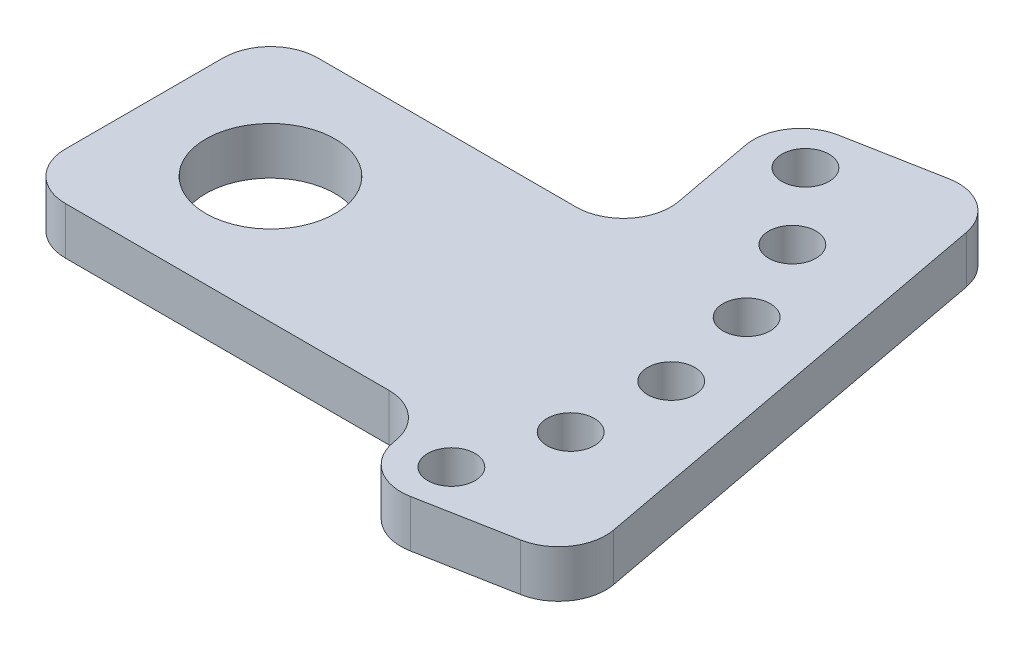
ISO-10303-21;
HEADER;
FILE_DESCRIPTION(('STEP AP214'),'2;1');
FILE_NAME('part.step','',(''),(''),'','','');
FILE_SCHEMA(('AUTOMOTIVE_DESIGN { 1 0 10303 214 1 1 1 1 }'));
ENDSEC;
DATA;
#1=APPLICATION_CONTEXT('core data for automotive mechanical design processes');
#2=APPLICATION_PROTOCOL_DEFINITION('international standard','automotive_design',2000,#1);
#3=PRODUCT_CONTEXT('',#1,'mechanical');
#4=PRODUCT('Part','Part','',(#3));
#5=PRODUCT_RELATED_PRODUCT_CATEGORY('part','',(#4));
#6=PRODUCT_DEFINITION_FORMATION('','',#4);
#7=PRODUCT_DEFINITION_CONTEXT('part definition',#1,'design');
#8=PRODUCT_DEFINITION('design','',#6,#7);
#9=PRODUCT_DEFINITION_SHAPE('','',#8);
#10=(LENGTH_UNIT() NAMED_UNIT(*) SI_UNIT(.MILLI.,.METRE.));
#11=(NAMED_UNIT(*) PLANE_ANGLE_UNIT() SI_UNIT($,.RADIAN.));
#12=(NAMED_UNIT(*) SI_UNIT($,.STERADIAN.) SOLID_ANGLE_UNIT());
#13=UNCERTAINTY_MEASURE_WITH_UNIT(LENGTH_MEASURE(1.E-05),#10,'distance_accuracy_value','');
#14=(GEOMETRIC_REPRESENTATION_CONTEXT(3) GLOBAL_UNCERTAINTY_ASSIGNED_CONTEXT((#13)) GLOBAL_UNIT_ASSIGNED_CONTEXT((#10,
#11,#12)) REPRESENTATION_CONTEXT('',''));
#15=CARTESIAN_POINT('',(0.,0.,0.));
#16=DIRECTION('',(0.,0.,1.));
#17=DIRECTION('',(1.,0.,0.));
#18=AXIS2_PLACEMENT_3D('',#15,#16,#17);
#19=CARTESIAN_POINT('',(135.881010461342,15.,-25.4776894615016));
#20=DIRECTION('',(0.982872186934322,0.,-0.184288535050185));
#21=DIRECTION('',(0.184288535050185,0.,0.982872186934322));
#22=AXIS2_PLACEMENT_3D('',#19,#20,#21);
#23=PLANE('',#22);
#24=DIRECTION('',(0.184288535050185,0.,0.982872186934322));
#25=VECTOR('',#24,1.);
#26=CARTESIAN_POINT('',(135.881010461342,0.,-25.4776894615016));
#27=LINE('',#26,#25);
#28=CARTESIAN_POINT('',(125.751975799736,0.,-79.4992076567357));
#29=VERTEX_POINT('',#28);
#30=CARTESIAN_POINT('',(151.552370706762,0.,58.1028985140693));
#31=VERTEX_POINT('',#30);
#32=EDGE_CURVE('E183',#29,#31,#27,.T.);
#33=ORIENTED_EDGE('',*,*,#32,.F.);
#34=DIRECTION('',(0.,1.,0.));
#35=VECTOR('',#34,1.);
#36=CARTESIAN_POINT('',(125.751975799736,15.,-79.4992076567357));
#37=LINE('',#36,#35);
#38=CARTESIAN_POINT('',(125.751975799736,15.,-79.4992076567357));
#39=VERTEX_POINT('',#38);
#40=EDGE_CURVE('E229',#39,#29,#37,.F.);
#41=ORIENTED_EDGE('',*,*,#40,.F.);
#42=DIRECTION('',(0.184288535050185,0.,0.982872186934322));
#43=VECTOR('',#42,1.);
#44=CARTESIAN_POINT('',(135.881010461342,15.,-25.4776894615016));
#45=LINE('',#44,#43);
#46=CARTESIAN_POINT('',(151.552370706762,15.,58.1028985140693));
#47=VERTEX_POINT('',#46);
#48=EDGE_CURVE('E306',#39,#47,#45,.T.);
#49=ORIENTED_EDGE('',*,*,#48,.T.);
#50=DIRECTION('',(0.,-1.,0.));
#51=VECTOR('',#50,1.);
#52=CARTESIAN_POINT('',(151.552370706762,15.,58.1028985140693));
#53=LINE('',#52,#51);
#54=EDGE_CURVE('E231',#31,#47,#53,.F.);
#55=ORIENTED_EDGE('',*,*,#54,.F.);
#56=EDGE_LOOP('',(#33,#41,#49,#55));
#57=FACE_BOUND('',#56,.T.);
#58=ADVANCED_FACE('F36',(#57),#23,.T.);
#59=CARTESIAN_POINT('',(18.4356882711724,15.,98.3236707795859));
#60=DIRECTION('',(-0.184288535050185,0.,-0.982872186934322));
#61=DIRECTION('',(0.982872186934322,0.,-0.184288535050185));
#62=AXIS2_PLACEMENT_3D('',#59,#60,#61);
#63=PLANE('',#62);
#64=DIRECTION('',(0.982872186934322,0.,-0.184288535050185));
#65=VECTOR('',#64,1.);
#66=CARTESIAN_POINT('',(18.4356882711724,0.,98.3236707795859));
#67=LINE('',#66,#65);
#68=CARTESIAN_POINT('',(110.08745032047,0.,81.1389653953425));
#69=VERTEX_POINT('',#68);
#70=CARTESIAN_POINT('',(139.5736159285,0.,75.6103093438369));
#71=VERTEX_POINT('',#70);
#72=EDGE_CURVE('E178',#69,#71,#67,.T.);
#73=ORIENTED_EDGE('',*,*,#72,.T.);
#74=DIRECTION('',(0.,1.,0.));
#75=VECTOR('',#74,1.);
#76=CARTESIAN_POINT('',(139.5736159285,15.,75.610309343837));
#77=LINE('',#76,#75);
#78=CARTESIAN_POINT('',(139.5736159285,15.,75.6103093438369));
#79=VERTEX_POINT('',#78);
#80=EDGE_CURVE('E202',#79,#71,#77,.F.);
#81=ORIENTED_EDGE('',*,*,#80,.F.);
#82=DIRECTION('',(0.982872186934322,0.,-0.184288535050185));
#83=VECTOR('',#82,1.);
#84=CARTESIAN_POINT('',(18.4356882711724,15.,98.3236707795859));
#85=LINE('',#84,#83);
#86=CARTESIAN_POINT('',(110.08745032047,15.,81.1389653953425));
#87=VERTEX_POINT('',#86);
#88=EDGE_CURVE('E304',#87,#79,#85,.T.);
#89=ORIENTED_EDGE('',*,*,#88,.F.);
#90=DIRECTION('',(0.,-1.,0.));
#91=VECTOR('',#90,1.);
#92=CARTESIAN_POINT('',(110.08745032047,15.,81.1389653953425));
#93=LINE('',#92,#91);
#94=EDGE_CURVE('E205',#69,#87,#93,.F.);
#95=ORIENTED_EDGE('',*,*,#94,.F.);
#96=EDGE_LOOP('',(#73,#81,#89,#95));
#97=FACE_BOUND('',#96,.T.);
#98=ADVANCED_FACE('F361',(#97),#63,.F.);
#99=CARTESIAN_POINT('',(76.908679245283,15.,-14.4203773584906));
#100=DIRECTION('',(0.982872186934322,0.,-0.184288535050185));
#101=DIRECTION('',(0.184288535050185,0.,0.982872186934322));
#102=AXIS2_PLACEMENT_3D('',#99,#100,#101);
#103=PLANE('',#102);
#104=DIRECTION('',(0.184288535050185,0.,0.982872186934322));
#105=VECTOR('',#104,1.);
#106=CARTESIAN_POINT('',(76.908679245283,0.,-14.4203773584906));
#107=LINE('',#106,#105);
#108=CARTESIAN_POINT('',(92.2941884951713,0.,67.6356719742472));
#109=VERTEX_POINT('',#108);
#110=CARTESIAN_POINT('',(92.5800394907026,0.,69.1602106170805));
#111=VERTEX_POINT('',#110);
#112=EDGE_CURVE('E166',#109,#111,#107,.T.);
#113=ORIENTED_EDGE('',*,*,#112,.T.);
#114=DIRECTION('',(0.,-1.,0.));
#115=VECTOR('',#114,1.);
#116=CARTESIAN_POINT('',(92.5800394907026,15.,69.1602106170805));
#117=LINE('',#116,#115);
#118=CARTESIAN_POINT('',(92.5800394907026,15.,69.1602106170805));
#119=VERTEX_POINT('',#118);
#120=EDGE_CURVE('E170',#119,#111,#117,.T.);
#121=ORIENTED_EDGE('',*,*,#120,.F.);
#122=DIRECTION('',(0.184288535050185,0.,0.982872186934322));
#123=VECTOR('',#122,1.);
#124=CARTESIAN_POINT('',(76.908679245283,15.,-14.4203773584906));
#125=LINE('',#124,#123);
#126=CARTESIAN_POINT('',(92.2941884951713,15.,67.6356719742472));
#127=VERTEX_POINT('',#126);
#128=EDGE_CURVE('E168',#127,#119,#125,.T.);
#129=ORIENTED_EDGE('',*,*,#128,.F.);
#130=DIRECTION('',(0.,1.,0.));
#131=VECTOR('',#130,1.);
#132=CARTESIAN_POINT('',(92.2941884951713,15.,67.6356719742472));
#133=LINE('',#132,#131);
#134=EDGE_CURVE('E153',#109,#127,#133,.T.);
#135=ORIENTED_EDGE('',*,*,#134,.F.);
#136=EDGE_LOOP('',(#113,#121,#129,#135));
#137=FACE_BOUND('',#136,.T.);
#138=ADVANCED_FACE('F164',(#137),#103,.F.);
#139=CARTESIAN_POINT('',(0.,15.,55.4));
#140=DIRECTION('',(0.,0.,1.));
#141=DIRECTION('',(-1.,0.,0.));
#142=AXIS2_PLACEMENT_3D('',#139,#140,#141);
#143=PLANE('',#142);
#144=DIRECTION('',(-1.,0.,0.));
#145=VECTOR('',#144,1.);
#146=CARTESIAN_POINT('',(0.,15.,55.4));
#147=LINE('',#146,#145);
#148=CARTESIAN_POINT('',(77.5511056911565,15.,55.4));
#149=VERTEX_POINT('',#148);
#150=CARTESIAN_POINT('',(-25.,15.,55.4));
#151=VERTEX_POINT('',#150);
#152=EDGE_CURVE('E298',#149,#151,#147,.T.);
#153=ORIENTED_EDGE('',*,*,#152,.T.);
#154=DIRECTION('',(0.,-1.,0.));
#155=VECTOR('',#154,1.);
#156=CARTESIAN_POINT('',(-25.,15.,55.4));
#157=LINE('',#156,#155);
#158=CARTESIAN_POINT('',(-25.,0.,55.4));
#159=VERTEX_POINT('',#158);
#160=EDGE_CURVE('E169',#159,#151,#157,.F.);
#161=ORIENTED_EDGE('',*,*,#160,.F.);
#162=DIRECTION('',(-1.,0.,0.));
#163=VECTOR('',#162,1.);
#164=CARTESIAN_POINT('',(0.,0.,55.4));
#165=LINE('',#164,#163);
#166=CARTESIAN_POINT('',(77.5511056911565,0.,55.4));
#167=VERTEX_POINT('',#166);
#168=EDGE_CURVE('E177',#167,#159,#165,.T.);
#169=ORIENTED_EDGE('',*,*,#168,.F.);
#170=DIRECTION('',(0.,-1.,0.));
#171=VECTOR('',#170,1.);
#172=CARTESIAN_POINT('',(77.5511056911565,0.,55.4));
#173=LINE('',#172,#171);
#174=EDGE_CURVE('E156',#149,#167,#173,.T.);
#175=ORIENTED_EDGE('',*,*,#174,.F.);
#176=EDGE_LOOP('',(#153,#161,#169,#175));
#177=FACE_BOUND('',#176,.T.);
#178=ADVANCED_FACE('F412',(#177),#143,.T.);
#179=CARTESIAN_POINT('',(-40.,15.,0.));
#180=DIRECTION('',(1.,0.,0.));
#181=DIRECTION('',(0.,0.,1.));
#182=AXIS2_PLACEMENT_3D('',#179,#180,#181);
#183=PLANE('',#182);
#184=DIRECTION('',(0.,0.,1.));
#185=VECTOR('',#184,1.);
#186=CARTESIAN_POINT('',(-40.,15.,0.));
#187=LINE('',#186,#185);
#188=CARTESIAN_POINT('',(-40.,15.,-9.60000000000003));
#189=VERTEX_POINT('',#188);
#190=CARTESIAN_POINT('',(-40.,15.,40.4));
#191=VERTEX_POINT('',#190);
#192=EDGE_CURVE('E299',#189,#191,#187,.T.);
#193=ORIENTED_EDGE('',*,*,#192,.F.);
#194=DIRECTION('',(0.,-1.,0.));
#195=VECTOR('',#194,1.);
#196=CARTESIAN_POINT('',(-40.,15.,-9.60000000000003));
#197=LINE('',#196,#195);
#198=CARTESIAN_POINT('',(-40.,0.,-9.60000000000003));
#199=VERTEX_POINT('',#198);
#200=EDGE_CURVE('E250',#199,#189,#197,.F.);
#201=ORIENTED_EDGE('',*,*,#200,.F.);
#202=DIRECTION('',(0.,0.,1.));
#203=VECTOR('',#202,1.);
#204=CARTESIAN_POINT('',(-40.,0.,0.));
#205=LINE('',#204,#203);
#206=CARTESIAN_POINT('',(-40.,0.,40.4));
#207=VERTEX_POINT('',#206);
#208=EDGE_CURVE('E180',#199,#207,#205,.T.);
#209=ORIENTED_EDGE('',*,*,#208,.T.);
#210=DIRECTION('',(0.,1.,0.));
#211=VECTOR('',#210,1.);
#212=CARTESIAN_POINT('',(-40.,15.,40.4));
#213=LINE('',#212,#211);
#214=EDGE_CURVE('E253',#191,#207,#213,.F.);
#215=ORIENTED_EDGE('',*,*,#214,.F.);
#216=EDGE_LOOP('',(#193,#201,#209,#215));
#217=FACE_BOUND('',#216,.T.);
#218=ADVANCED_FACE('F290',(#217),#183,.F.);
#219=CARTESIAN_POINT('',(0.,15.,-24.6));
#220=DIRECTION('',(0.,0.,1.));
#221=DIRECTION('',(-1.,0.,0.));
#222=AXIS2_PLACEMENT_3D('',#219,#220,#221);
#223=PLANE('',#222);
#224=DIRECTION('',(-1.,0.,0.));
#225=VECTOR('',#224,1.);
#226=CARTESIAN_POINT('',(0.,0.,-24.6));
#227=LINE('',#226,#225);
#228=CARTESIAN_POINT('',(56.9261056911565,0.,-24.6));
#229=VERTEX_POINT('',#228);
#230=CARTESIAN_POINT('',(-25.,0.,-24.6));
#231=VERTEX_POINT('',#230);
#232=EDGE_CURVE('E196',#229,#231,#227,.T.);
#233=ORIENTED_EDGE('',*,*,#232,.T.);
#234=DIRECTION('',(0.,-1.,0.));
#235=VECTOR('',#234,1.);
#236=CARTESIAN_POINT('',(-25.,15.,-24.6));
#237=LINE('',#236,#235);
#238=CARTESIAN_POINT('',(-25.,15.,-24.6));
#239=VERTEX_POINT('',#238);
#240=EDGE_CURVE('E244',#239,#231,#237,.T.);
#241=ORIENTED_EDGE('',*,*,#240,.F.);
#242=DIRECTION('',(-1.,0.,0.));
#243=VECTOR('',#242,1.);
#244=CARTESIAN_POINT('',(0.,15.,-24.6));
#245=LINE('',#244,#243);
#246=CARTESIAN_POINT('',(56.9261056911565,15.,-24.6));
#247=VERTEX_POINT('',#246);
#248=EDGE_CURVE('E300',#247,#239,#245,.T.);
#249=ORIENTED_EDGE('',*,*,#248,.F.);
#250=DIRECTION('',(0.,-1.,0.));
#251=VECTOR('',#250,1.);
#252=CARTESIAN_POINT('',(56.9261056911565,15.,-24.6));
#253=LINE('',#252,#251);
#254=EDGE_CURVE('E247',#229,#247,#253,.F.);
#255=ORIENTED_EDGE('',*,*,#254,.F.);
#256=EDGE_LOOP('',(#233,#241,#249,#255));
#257=FACE_BOUND('',#256,.T.);
#258=ADVANCED_FACE('F404',(#257),#223,.F.);
#259=DIRECTION('',(0.184288535050185,0.,0.982872186934322));
#260=VECTOR('',#259,1.);
#261=CARTESIAN_POINT('',(76.908679245283,0.,-14.4203773584906));
#262=LINE('',#261,#260);
#263=CARTESIAN_POINT('',(66.7796445836767,0.,-68.4418955537245));
#264=VERTEX_POINT('',#263);
#265=CARTESIAN_POINT('',(71.6691884951714,0.,-42.3643280257528));
#266=VERTEX_POINT('',#265);
#267=EDGE_CURVE('E191',#264,#266,#262,.T.);
#268=ORIENTED_EDGE('',*,*,#267,.T.);
#269=DIRECTION('',(0.,-1.,0.));
#270=VECTOR('',#269,1.);
#271=CARTESIAN_POINT('',(71.6691884951714,0.,-42.3643280257528));
#272=LINE('',#271,#270);
#273=CARTESIAN_POINT('',(71.6691884951714,15.,-42.3643280257528));
#274=VERTEX_POINT('',#273);
#275=EDGE_CURVE('E238',#274,#266,#272,.T.);
#276=ORIENTED_EDGE('',*,*,#275,.F.);
#277=CARTESIAN_POINT('',(66.7796445836767,15.,-68.4418955537245));
#278=VERTEX_POINT('',#277);
#279=EDGE_CURVE('E195',#278,#274,#125,.T.);
#280=ORIENTED_EDGE('',*,*,#279,.F.);
#281=DIRECTION('',(0.,1.,0.));
#282=VECTOR('',#281,1.);
#283=CARTESIAN_POINT('',(66.7796445836767,15.,-68.4418955537245));
#284=LINE('',#283,#282);
#285=EDGE_CURVE('E241',#264,#278,#284,.T.);
#286=ORIENTED_EDGE('',*,*,#285,.F.);
#287=EDGE_LOOP('',(#268,#276,#280,#286));
#288=FACE_BOUND('',#287,.T.);
#289=ADVANCED_FACE('F274',(#288),#103,.F.);
#290=CARTESIAN_POINT('',(-12.8933626873591,15.,-68.7646009992488));
#291=DIRECTION('',(-0.184288535050185,0.,-0.982872186934322));
#292=DIRECTION('',(0.982872186934322,0.,-0.184288535050185));
#293=AXIS2_PLACEMENT_3D('',#290,#291,#292);
#294=PLANE('',#293);
#295=DIRECTION('',(0.982872186934322,0.,-0.184288535050185));
#296=VECTOR('',#295,1.);
#297=CARTESIAN_POINT('',(-12.8933626873591,0.,-68.7646009992488));
#298=LINE('',#297,#296);
#299=CARTESIAN_POINT('',(78.7583993619387,0.,-85.9493063834922));
#300=VERTEX_POINT('',#299);
#301=CARTESIAN_POINT('',(108.244564969968,0.,-91.4779624349977));
#302=VERTEX_POINT('',#301);
#303=EDGE_CURVE('E189',#300,#302,#298,.T.);
#304=ORIENTED_EDGE('',*,*,#303,.F.);
#305=DIRECTION('',(0.,-1.,0.));
#306=VECTOR('',#305,1.);
#307=CARTESIAN_POINT('',(78.7583993619387,15.,-85.9493063834922));
#308=LINE('',#307,#306);
#309=CARTESIAN_POINT('',(78.7583993619387,15.,-85.9493063834922));
#310=VERTEX_POINT('',#309);
#311=EDGE_CURVE('E234',#310,#300,#308,.T.);
#312=ORIENTED_EDGE('',*,*,#311,.F.);
#313=DIRECTION('',(0.982872186934322,0.,-0.184288535050185));
#314=VECTOR('',#313,1.);
#315=CARTESIAN_POINT('',(-12.8933626873591,15.,-68.7646009992488));
#316=LINE('',#315,#314);
#317=CARTESIAN_POINT('',(108.244564969968,15.,-91.4779624349977));
#318=VERTEX_POINT('',#317);
#319=EDGE_CURVE('E272',#310,#318,#316,.T.);
#320=ORIENTED_EDGE('',*,*,#319,.T.);
#321=DIRECTION('',(0.,1.,0.));
#322=VECTOR('',#321,1.);
#323=CARTESIAN_POINT('',(108.244564969968,15.,-91.4779624349977));
#324=LINE('',#323,#322);
#325=EDGE_CURVE('E236',#302,#318,#324,.T.);
#326=ORIENTED_EDGE('',*,*,#325,.F.);
#327=EDGE_LOOP('',(#304,#312,#320,#326));
#328=FACE_BOUND('',#327,.T.);
#329=ADVANCED_FACE('F372',(#328),#294,.T.);
#330=CARTESIAN_POINT('',(0.,15.,15.4));
#331=DIRECTION('',(0.,1.,0.));
#332=DIRECTION('',(0.,0.,1.));
#333=AXIS2_PLACEMENT_3D('',#330,#331,#332);
#334=CYLINDRICAL_SURFACE('',#333,20.5);
#335=CARTESIAN_POINT('',(0.,15.,15.4));
#336=DIRECTION('',(0.,-1.,0.));
#337=DIRECTION('',(0.,0.,1.));
#338=AXIS2_PLACEMENT_3D('',#335,#336,#337);
#339=CIRCLE('',#338,20.5);
#340=CARTESIAN_POINT('',(0.,15.,35.9));
#341=VERTEX_POINT('',#340);
#342=EDGE_CURVE('E197',#341,#341,#339,.T.);
#343=ORIENTED_EDGE('',*,*,#342,.F.);
#344=EDGE_LOOP('',(#343));
#345=FACE_BOUND('',#344,.T.);
#346=CARTESIAN_POINT('',(0.,0.,15.4));
#347=DIRECTION('',(0.,-1.,0.));
#348=DIRECTION('',(0.,0.,1.));
#349=AXIS2_PLACEMENT_3D('',#346,#347,#348);
#350=CIRCLE('',#349,20.5);
#351=CARTESIAN_POINT('',(0.,0.,35.9));
#352=VERTEX_POINT('',#351);
#353=EDGE_CURVE('E192',#352,#352,#350,.T.);
#354=ORIENTED_EDGE('',*,*,#353,.T.);
#355=EDGE_LOOP('',(#354));
#356=FACE_BOUND('',#355,.T.);
#357=ADVANCED_FACE('F375',(#345,#356),#334,.F.);
#358=CARTESIAN_POINT('',(0.,15.,0.));
#359=DIRECTION('',(0.,1.,0.));
#360=DIRECTION('',(0.,0.,1.));
#361=AXIS2_PLACEMENT_3D('',#358,#359,#360);
#362=PLANE('',#361);
#363=CARTESIAN_POINT('',(108.541109972621,15.,66.5744804166233));
#364=DIRECTION('',(0.,-1.,0.));
#365=DIRECTION('',(0.,0.,1.));
#366=AXIS2_PLACEMENT_3D('',#363,#364,#365);
#367=CIRCLE('',#366,7.49999999999999);
#368=CARTESIAN_POINT('',(108.541109972621,15.,74.0744804166232));
#369=VERTEX_POINT('',#368);
#370=EDGE_CURVE('E340',#369,#369,#367,.T.);
#371=ORIENTED_EDGE('',*,*,#370,.T.);
#372=EDGE_LOOP('',(#371));
#373=FACE_BOUND('',#372,.T.);
#374=CARTESIAN_POINT('',(117.842476722414,15.,38.0528294022474));
#375=DIRECTION('',(0.,-1.,0.));
#376=DIRECTION('',(0.,0.,1.));
#377=AXIS2_PLACEMENT_3D('',#374,#375,#376);
#378=CIRCLE('',#377,7.49999999999999);
#379=CARTESIAN_POINT('',(117.842476722414,15.,45.5528294022474));
#380=VERTEX_POINT('',#379);
#381=EDGE_CURVE('E334',#380,#380,#378,.T.);
#382=ORIENTED_EDGE('',*,*,#381,.T.);
#383=EDGE_LOOP('',(#382));
#384=FACE_BOUND('',#383,.T.);
#385=CARTESIAN_POINT('',(119.778688677056,15.,8.11537655023096));
#386=DIRECTION('',(0.,-1.,0.));
#387=DIRECTION('',(0.,0.,1.));
#388=AXIS2_PLACEMENT_3D('',#385,#386,#387);
#389=CIRCLE('',#388,7.49999999999999);
#390=CARTESIAN_POINT('',(119.778688677056,15.,15.615376550231));
#391=VERTEX_POINT('',#390);
#392=EDGE_CURVE('E328',#391,#391,#389,.T.);
#393=ORIENTED_EDGE('',*,*,#392,.T.);
#394=EDGE_LOOP('',(#393));
#395=FACE_BOUND('',#394,.T.);
#396=CARTESIAN_POINT('',(114.228732589382,15.,-21.366787336175));
#397=DIRECTION('',(0.,-1.,0.));
#398=DIRECTION('',(0.,0.,1.));
#399=AXIS2_PLACEMENT_3D('',#396,#397,#398);
#400=CIRCLE('',#399,7.49999999999999);
#401=CARTESIAN_POINT('',(114.228732589382,15.,-13.866787336175));
#402=VERTEX_POINT('',#401);
#403=EDGE_CURVE('E322',#402,#402,#400,.T.);
#404=ORIENTED_EDGE('',*,*,#403,.T.);
#405=EDGE_LOOP('',(#404));
#406=FACE_BOUND('',#405,.T.);
#407=CARTESIAN_POINT('',(101.539480714871,15.,-48.5510270140699));
#408=DIRECTION('',(0.,-1.,0.));
#409=DIRECTION('',(0.,0.,1.));
#410=AXIS2_PLACEMENT_3D('',#407,#408,#409);
#411=CIRCLE('',#410,7.49999999999999);
#412=CARTESIAN_POINT('',(101.539480714871,15.,-41.0510270140699));
#413=VERTEX_POINT('',#412);
#414=EDGE_CURVE('E316',#413,#413,#411,.T.);
#415=ORIENTED_EDGE('',*,*,#414,.T.);
#416=EDGE_LOOP('',(#415));
#417=FACE_BOUND('',#416,.T.);
#418=CARTESIAN_POINT('',(82.5040112956812,15.,-71.7383275035854));
#419=DIRECTION('',(0.,-1.,0.));
#420=DIRECTION('',(0.,0.,1.));
#421=AXIS2_PLACEMENT_3D('',#418,#419,#420);
#422=CIRCLE('',#421,7.49999999999999);
#423=CARTESIAN_POINT('',(82.5040112956812,15.,-64.2383275035855));
#424=VERTEX_POINT('',#423);
#425=EDGE_CURVE('E278',#424,#424,#422,.T.);
#426=ORIENTED_EDGE('',*,*,#425,.T.);
#427=EDGE_LOOP('',(#426));
#428=FACE_BOUND('',#427,.T.);
#429=ORIENTED_EDGE('',*,*,#88,.T.);
#430=CARTESIAN_POINT('',(136.809287902747,15.,60.8672265398221));
#431=DIRECTION('',(0.,-1.,0.));
#432=DIRECTION('',(0.,0.,1.));
#433=AXIS2_PLACEMENT_3D('',#430,#431,#432);
#434=CIRCLE('',#433,15.);
#435=EDGE_CURVE('E216',#47,#79,#434,.T.);
#436=ORIENTED_EDGE('',*,*,#435,.F.);
#437=ORIENTED_EDGE('',*,*,#48,.F.);
#438=CARTESIAN_POINT('',(111.008892995721,15.,-76.7348796309829));
#439=DIRECTION('',(0.,-1.,0.));
#440=DIRECTION('',(0.,0.,1.));
#441=AXIS2_PLACEMENT_3D('',#438,#439,#440);
#442=CIRCLE('',#441,15.);
#443=EDGE_CURVE('E214',#318,#39,#442,.T.);
#444=ORIENTED_EDGE('',*,*,#443,.F.);
#445=ORIENTED_EDGE('',*,*,#319,.F.);
#446=CARTESIAN_POINT('',(81.5227273876915,15.,-71.2062235794773));
#447=DIRECTION('',(0.,-1.,0.));
#448=DIRECTION('',(0.,0.,1.));
#449=AXIS2_PLACEMENT_3D('',#446,#447,#448);
#450=CIRCLE('',#449,15.);
#451=EDGE_CURVE('E212',#278,#310,#450,.T.);
#452=ORIENTED_EDGE('',*,*,#451,.F.);
#453=ORIENTED_EDGE('',*,*,#279,.T.);
#454=CARTESIAN_POINT('',(56.9261056911565,15.,-39.6));
#455=DIRECTION('',(0.,-1.,0.));
#456=DIRECTION('',(0.,0.,1.));
#457=AXIS2_PLACEMENT_3D('',#454,#455,#456);
#458=CIRCLE('',#457,15.);
#459=EDGE_CURVE('E44',#247,#274,#458,.F.);
#460=ORIENTED_EDGE('',*,*,#459,.F.);
#461=ORIENTED_EDGE('',*,*,#248,.T.);
#462=CARTESIAN_POINT('',(-25.,15.,-9.60000000000002));
#463=DIRECTION('',(0.,-1.,0.));
#464=DIRECTION('',(0.,0.,1.));
#465=AXIS2_PLACEMENT_3D('',#462,#463,#464);
#466=CIRCLE('',#465,15.);
#467=EDGE_CURVE('E208',#189,#239,#466,.T.);
#468=ORIENTED_EDGE('',*,*,#467,.F.);
#469=ORIENTED_EDGE('',*,*,#192,.T.);
#470=CARTESIAN_POINT('',(-25.,15.,40.4));
#471=DIRECTION('',(0.,-1.,0.));
#472=DIRECTION('',(0.,0.,1.));
#473=AXIS2_PLACEMENT_3D('',#470,#471,#472);
#474=CIRCLE('',#473,15.);
#475=EDGE_CURVE('E210',#151,#191,#474,.T.);
#476=ORIENTED_EDGE('',*,*,#475,.F.);
#477=ORIENTED_EDGE('',*,*,#152,.F.);
#478=CARTESIAN_POINT('',(77.5511056911565,15.,70.4));
#479=DIRECTION('',(0.,-1.,0.));
#480=DIRECTION('',(0.,0.,1.));
#481=AXIS2_PLACEMENT_3D('',#478,#479,#480);
#482=CIRCLE('',#481,15.);
#483=EDGE_CURVE('E160',#127,#149,#482,.F.);
#484=ORIENTED_EDGE('',*,*,#483,.F.);
#485=ORIENTED_EDGE('',*,*,#128,.T.);
#486=CARTESIAN_POINT('',(107.323122294717,15.,66.3958825913277));
#487=DIRECTION('',(0.,-1.,0.));
#488=DIRECTION('',(0.,0.,1.));
#489=AXIS2_PLACEMENT_3D('',#486,#487,#488);
#490=CIRCLE('',#489,15.);
#491=EDGE_CURVE('E218',#87,#119,#490,.T.);
#492=ORIENTED_EDGE('',*,*,#491,.F.);
#493=EDGE_LOOP('',(#429,#436,#437,#444,#445,#452,#453,#460,#461,#468,#469,#476,#477,#484,#485,#492));
#494=FACE_BOUND('',#493,.T.);
#495=ORIENTED_EDGE('',*,*,#342,.T.);
#496=EDGE_LOOP('',(#495));
#497=FACE_BOUND('',#496,.T.);
#498=ADVANCED_FACE('F267',(#373,#384,#395,#406,#417,#428,#494,#497),#362,.T.);
#499=CARTESIAN_POINT('',(0.,0.,0.));
#500=DIRECTION('',(0.,1.,0.));
#501=DIRECTION('',(0.,0.,1.));
#502=AXIS2_PLACEMENT_3D('',#499,#500,#501);
#503=PLANE('',#502);
#504=CARTESIAN_POINT('',(108.541109972621,0.,66.5744804166233));
#505=DIRECTION('',(0.,-1.,0.));
#506=DIRECTION('',(0.,0.,1.));
#507=AXIS2_PLACEMENT_3D('',#504,#505,#506);
#508=CIRCLE('',#507,7.49999999999999);
#509=CARTESIAN_POINT('',(108.541109972621,0.,74.0744804166232));
#510=VERTEX_POINT('',#509);
#511=EDGE_CURVE('E337',#510,#510,#508,.T.);
#512=ORIENTED_EDGE('',*,*,#511,.F.);
#513=EDGE_LOOP('',(#512));
#514=FACE_BOUND('',#513,.T.);
#515=CARTESIAN_POINT('',(117.842476722414,0.,38.0528294022474));
#516=DIRECTION('',(0.,-1.,0.));
#517=DIRECTION('',(0.,0.,1.));
#518=AXIS2_PLACEMENT_3D('',#515,#516,#517);
#519=CIRCLE('',#518,7.49999999999999);
#520=CARTESIAN_POINT('',(117.842476722414,0.,45.5528294022474));
#521=VERTEX_POINT('',#520);
#522=EDGE_CURVE('E331',#521,#521,#519,.T.);
#523=ORIENTED_EDGE('',*,*,#522,.F.);
#524=EDGE_LOOP('',(#523));
#525=FACE_BOUND('',#524,.T.);
#526=CARTESIAN_POINT('',(119.778688677056,0.,8.11537655023096));
#527=DIRECTION('',(0.,-1.,0.));
#528=DIRECTION('',(0.,0.,1.));
#529=AXIS2_PLACEMENT_3D('',#526,#527,#528);
#530=CIRCLE('',#529,7.49999999999999);
#531=CARTESIAN_POINT('',(119.778688677056,0.,15.615376550231));
#532=VERTEX_POINT('',#531);
#533=EDGE_CURVE('E325',#532,#532,#530,.T.);
#534=ORIENTED_EDGE('',*,*,#533,.F.);
#535=EDGE_LOOP('',(#534));
#536=FACE_BOUND('',#535,.T.);
#537=CARTESIAN_POINT('',(114.228732589382,0.,-21.366787336175));
#538=DIRECTION('',(0.,-1.,0.));
#539=DIRECTION('',(0.,0.,1.));
#540=AXIS2_PLACEMENT_3D('',#537,#538,#539);
#541=CIRCLE('',#540,7.49999999999999);
#542=CARTESIAN_POINT('',(114.228732589382,0.,-13.866787336175));
#543=VERTEX_POINT('',#542);
#544=EDGE_CURVE('E319',#543,#543,#541,.T.);
#545=ORIENTED_EDGE('',*,*,#544,.F.);
#546=EDGE_LOOP('',(#545));
#547=FACE_BOUND('',#546,.T.);
#548=CARTESIAN_POINT('',(101.539480714871,0.,-48.5510270140699));
#549=DIRECTION('',(0.,-1.,0.));
#550=DIRECTION('',(0.,0.,1.));
#551=AXIS2_PLACEMENT_3D('',#548,#549,#550);
#552=CIRCLE('',#551,7.49999999999999);
#553=CARTESIAN_POINT('',(101.539480714871,0.,-41.0510270140699));
#554=VERTEX_POINT('',#553);
#555=EDGE_CURVE('E313',#554,#554,#552,.T.);
#556=ORIENTED_EDGE('',*,*,#555,.F.);
#557=EDGE_LOOP('',(#556));
#558=FACE_BOUND('',#557,.T.);
#559=CARTESIAN_POINT('',(82.5040112956812,0.,-71.7383275035854));
#560=DIRECTION('',(0.,-1.,0.));
#561=DIRECTION('',(0.,0.,1.));
#562=AXIS2_PLACEMENT_3D('',#559,#560,#561);
#563=CIRCLE('',#562,7.49999999999999);
#564=CARTESIAN_POINT('',(82.5040112956812,0.,-64.2383275035855));
#565=VERTEX_POINT('',#564);
#566=EDGE_CURVE('E275',#565,#565,#563,.T.);
#567=ORIENTED_EDGE('',*,*,#566,.F.);
#568=EDGE_LOOP('',(#567));
#569=FACE_BOUND('',#568,.T.);
#570=ORIENTED_EDGE('',*,*,#112,.F.);
#571=CARTESIAN_POINT('',(77.5511056911565,0.,70.4));
#572=DIRECTION('',(0.,-1.,0.));
#573=DIRECTION('',(0.,0.,1.));
#574=AXIS2_PLACEMENT_3D('',#571,#572,#573);
#575=CIRCLE('',#574,15.);
#576=EDGE_CURVE('E150',#167,#109,#575,.T.);
#577=ORIENTED_EDGE('',*,*,#576,.F.);
#578=ORIENTED_EDGE('',*,*,#168,.T.);
#579=CARTESIAN_POINT('',(-25.,0.,40.4));
#580=DIRECTION('',(0.,-1.,0.));
#581=DIRECTION('',(0.,0.,1.));
#582=AXIS2_PLACEMENT_3D('',#579,#580,#581);
#583=CIRCLE('',#582,15.);
#584=EDGE_CURVE('E222',#207,#159,#583,.F.);
#585=ORIENTED_EDGE('',*,*,#584,.F.);
#586=ORIENTED_EDGE('',*,*,#208,.F.);
#587=CARTESIAN_POINT('',(-25.,0.,-9.60000000000002));
#588=DIRECTION('',(0.,-1.,0.));
#589=DIRECTION('',(0.,0.,1.));
#590=AXIS2_PLACEMENT_3D('',#587,#588,#589);
#591=CIRCLE('',#590,15.);
#592=EDGE_CURVE('E220',#231,#199,#591,.F.);
#593=ORIENTED_EDGE('',*,*,#592,.F.);
#594=ORIENTED_EDGE('',*,*,#232,.F.);
#595=CARTESIAN_POINT('',(56.9261056911565,0.,-39.6));
#596=DIRECTION('',(0.,-1.,0.));
#597=DIRECTION('',(0.,0.,1.));
#598=AXIS2_PLACEMENT_3D('',#595,#596,#597);
#599=CIRCLE('',#598,15.);
#600=EDGE_CURVE('E11',#266,#229,#599,.T.);
#601=ORIENTED_EDGE('',*,*,#600,.F.);
#602=ORIENTED_EDGE('',*,*,#267,.F.);
#603=CARTESIAN_POINT('',(81.5227273876915,0.,-71.2062235794773));
#604=DIRECTION('',(0.,-1.,0.));
#605=DIRECTION('',(0.,0.,1.));
#606=AXIS2_PLACEMENT_3D('',#603,#604,#605);
#607=CIRCLE('',#606,15.);
#608=EDGE_CURVE('E59',#300,#264,#607,.F.);
#609=ORIENTED_EDGE('',*,*,#608,.F.);
#610=ORIENTED_EDGE('',*,*,#303,.T.);
#611=CARTESIAN_POINT('',(111.008892995721,0.,-76.7348796309829));
#612=DIRECTION('',(0.,-1.,0.));
#613=DIRECTION('',(0.,0.,1.));
#614=AXIS2_PLACEMENT_3D('',#611,#612,#613);
#615=CIRCLE('',#614,15.);
#616=EDGE_CURVE('E51',#29,#302,#615,.F.);
#617=ORIENTED_EDGE('',*,*,#616,.F.);
#618=ORIENTED_EDGE('',*,*,#32,.T.);
#619=CARTESIAN_POINT('',(136.809287902747,0.,60.8672265398221));
#620=DIRECTION('',(0.,-1.,0.));
#621=DIRECTION('',(0.,0.,1.));
#622=AXIS2_PLACEMENT_3D('',#619,#620,#621);
#623=CIRCLE('',#622,15.);
#624=EDGE_CURVE('E226',#71,#31,#623,.F.);
#625=ORIENTED_EDGE('',*,*,#624,.F.);
#626=ORIENTED_EDGE('',*,*,#72,.F.);
#627=CARTESIAN_POINT('',(107.323122294717,0.,66.3958825913277));
#628=DIRECTION('',(0.,-1.,0.));
#629=DIRECTION('',(0.,0.,1.));
#630=AXIS2_PLACEMENT_3D('',#627,#628,#629);
#631=CIRCLE('',#630,15.);
#632=EDGE_CURVE('E175',#111,#69,#631,.F.);
#633=ORIENTED_EDGE('',*,*,#632,.F.);
#634=EDGE_LOOP('',(#570,#577,#578,#585,#586,#593,#594,#601,#602,#609,#610,#617,#618,#625,#626,#633));
#635=FACE_BOUND('',#634,.T.);
#636=ORIENTED_EDGE('',*,*,#353,.F.);
#637=EDGE_LOOP('',(#636));
#638=FACE_BOUND('',#637,.T.);
#639=ADVANCED_FACE('F172',(#514,#525,#536,#547,#558,#569,#635,#638),#503,.F.);
#640=CARTESIAN_POINT('',(82.5040112956812,15.,-71.7383275035854));
#641=DIRECTION('',(0.,1.,0.));
#642=DIRECTION('',(0.,0.,1.));
#643=AXIS2_PLACEMENT_3D('',#640,#641,#642);
#644=CYLINDRICAL_SURFACE('',#643,7.49999999999999);
#645=ORIENTED_EDGE('',*,*,#566,.T.);
#646=EDGE_LOOP('',(#645));
#647=FACE_BOUND('',#646,.T.);
#648=ORIENTED_EDGE('',*,*,#425,.F.);
#649=EDGE_LOOP('',(#648));
#650=FACE_BOUND('',#649,.T.);
#651=ADVANCED_FACE('F450',(#647,#650),#644,.F.);
#652=CARTESIAN_POINT('',(101.539480714871,15.,-48.5510270140699));
#653=DIRECTION('',(0.,1.,0.));
#654=DIRECTION('',(0.,0.,1.));
#655=AXIS2_PLACEMENT_3D('',#652,#653,#654);
#656=CYLINDRICAL_SURFACE('',#655,7.49999999999999);
#657=ORIENTED_EDGE('',*,*,#555,.T.);
#658=EDGE_LOOP('',(#657));
#659=FACE_BOUND('',#658,.T.);
#660=ORIENTED_EDGE('',*,*,#414,.F.);
#661=EDGE_LOOP('',(#660));
#662=FACE_BOUND('',#661,.T.);
#663=ADVANCED_FACE('F469',(#659,#662),#656,.F.);
#664=CARTESIAN_POINT('',(114.228732589382,15.,-21.366787336175));
#665=DIRECTION('',(0.,1.,0.));
#666=DIRECTION('',(0.,0.,1.));
#667=AXIS2_PLACEMENT_3D('',#664,#665,#666);
#668=CYLINDRICAL_SURFACE('',#667,7.49999999999999);
#669=ORIENTED_EDGE('',*,*,#544,.T.);
#670=EDGE_LOOP('',(#669));
#671=FACE_BOUND('',#670,.T.);
#672=ORIENTED_EDGE('',*,*,#403,.F.);
#673=EDGE_LOOP('',(#672));
#674=FACE_BOUND('',#673,.T.);
#675=ADVANCED_FACE('F478',(#671,#674),#668,.F.);
#676=CARTESIAN_POINT('',(119.778688677056,15.,8.11537655023096));
#677=DIRECTION('',(0.,1.,0.));
#678=DIRECTION('',(0.,0.,1.));
#679=AXIS2_PLACEMENT_3D('',#676,#677,#678);
#680=CYLINDRICAL_SURFACE('',#679,7.49999999999999);
#681=ORIENTED_EDGE('',*,*,#533,.T.);
#682=EDGE_LOOP('',(#681));
#683=FACE_BOUND('',#682,.T.);
#684=ORIENTED_EDGE('',*,*,#392,.F.);
#685=EDGE_LOOP('',(#684));
#686=FACE_BOUND('',#685,.T.);
#687=ADVANCED_FACE('F357',(#683,#686),#680,.F.);
#688=CARTESIAN_POINT('',(117.842476722414,15.,38.0528294022474));
#689=DIRECTION('',(0.,1.,0.));
#690=DIRECTION('',(0.,0.,1.));
#691=AXIS2_PLACEMENT_3D('',#688,#689,#690);
#692=CYLINDRICAL_SURFACE('',#691,7.49999999999999);
#693=ORIENTED_EDGE('',*,*,#522,.T.);
#694=EDGE_LOOP('',(#693));
#695=FACE_BOUND('',#694,.T.);
#696=ORIENTED_EDGE('',*,*,#381,.F.);
#697=EDGE_LOOP('',(#696));
#698=FACE_BOUND('',#697,.T.);
#699=ADVANCED_FACE('F348',(#695,#698),#692,.F.);
#700=CARTESIAN_POINT('',(108.541109972621,15.,66.5744804166233));
#701=DIRECTION('',(0.,1.,0.));
#702=DIRECTION('',(0.,0.,1.));
#703=AXIS2_PLACEMENT_3D('',#700,#701,#702);
#704=CYLINDRICAL_SURFACE('',#703,7.49999999999999);
#705=ORIENTED_EDGE('',*,*,#511,.T.);
#706=EDGE_LOOP('',(#705));
#707=FACE_BOUND('',#706,.T.);
#708=ORIENTED_EDGE('',*,*,#370,.F.);
#709=EDGE_LOOP('',(#708));
#710=FACE_BOUND('',#709,.T.);
#711=ADVANCED_FACE('F346',(#707,#710),#704,.F.);
#712=CARTESIAN_POINT('',(77.5511056911565,15.,70.4));
#713=DIRECTION('',(0.,1.,0.));
#714=DIRECTION('',(0.,0.,1.));
#715=AXIS2_PLACEMENT_3D('',#712,#713,#714);
#716=CYLINDRICAL_SURFACE('',#715,15.);
#717=ORIENTED_EDGE('',*,*,#576,.T.);
#718=ORIENTED_EDGE('',*,*,#134,.T.);
#719=ORIENTED_EDGE('',*,*,#483,.T.);
#720=ORIENTED_EDGE('',*,*,#174,.T.);
#721=EDGE_LOOP('',(#717,#718,#719,#720));
#722=FACE_BOUND('',#721,.T.);
#723=ADVANCED_FACE('F152',(#722),#716,.F.);
#724=CARTESIAN_POINT('',(107.323122294717,15.,66.3958825913277));
#725=DIRECTION('',(0.,1.,0.));
#726=DIRECTION('',(0.,0.,1.));
#727=AXIS2_PLACEMENT_3D('',#724,#725,#726);
#728=CYLINDRICAL_SURFACE('',#727,15.);
#729=ORIENTED_EDGE('',*,*,#632,.T.);
#730=ORIENTED_EDGE('',*,*,#94,.T.);
#731=ORIENTED_EDGE('',*,*,#491,.T.);
#732=ORIENTED_EDGE('',*,*,#120,.T.);
#733=EDGE_LOOP('',(#729,#730,#731,#732));
#734=FACE_BOUND('',#733,.T.);
#735=ADVANCED_FACE('F355',(#734),#728,.T.);
#736=CARTESIAN_POINT('',(136.809287902747,15.,60.8672265398221));
#737=DIRECTION('',(0.,-1.,0.));
#738=DIRECTION('',(0.,0.,-1.));
#739=AXIS2_PLACEMENT_3D('',#736,#737,#738);
#740=CYLINDRICAL_SURFACE('',#739,15.);
#741=ORIENTED_EDGE('',*,*,#624,.T.);
#742=ORIENTED_EDGE('',*,*,#54,.T.);
#743=ORIENTED_EDGE('',*,*,#435,.T.);
#744=ORIENTED_EDGE('',*,*,#80,.T.);
#745=EDGE_LOOP('',(#741,#742,#743,#744));
#746=FACE_BOUND('',#745,.T.);
#747=ADVANCED_FACE('F382',(#746),#740,.T.);
#748=CARTESIAN_POINT('',(111.008892995721,15.,-76.7348796309829));
#749=DIRECTION('',(0.,1.,0.));
#750=DIRECTION('',(0.,0.,1.));
#751=AXIS2_PLACEMENT_3D('',#748,#749,#750);
#752=CYLINDRICAL_SURFACE('',#751,15.);
#753=ORIENTED_EDGE('',*,*,#616,.T.);
#754=ORIENTED_EDGE('',*,*,#325,.T.);
#755=ORIENTED_EDGE('',*,*,#443,.T.);
#756=ORIENTED_EDGE('',*,*,#40,.T.);
#757=EDGE_LOOP('',(#753,#754,#755,#756));
#758=FACE_BOUND('',#757,.T.);
#759=ADVANCED_FACE('F386',(#758),#752,.T.);
#760=CARTESIAN_POINT('',(81.5227273876915,15.,-71.2062235794773));
#761=DIRECTION('',(0.,-1.,0.));
#762=DIRECTION('',(0.,0.,-1.));
#763=AXIS2_PLACEMENT_3D('',#760,#761,#762);
#764=CYLINDRICAL_SURFACE('',#763,15.);
#765=ORIENTED_EDGE('',*,*,#608,.T.);
#766=ORIENTED_EDGE('',*,*,#285,.T.);
#767=ORIENTED_EDGE('',*,*,#451,.T.);
#768=ORIENTED_EDGE('',*,*,#311,.T.);
#769=EDGE_LOOP('',(#765,#766,#767,#768));
#770=FACE_BOUND('',#769,.T.);
#771=ADVANCED_FACE('F390',(#770),#764,.T.);
#772=CARTESIAN_POINT('',(56.9261056911565,15.,-39.6));
#773=DIRECTION('',(0.,-1.,0.));
#774=DIRECTION('',(0.,0.,-1.));
#775=AXIS2_PLACEMENT_3D('',#772,#773,#774);
#776=CYLINDRICAL_SURFACE('',#775,15.);
#777=ORIENTED_EDGE('',*,*,#600,.T.);
#778=ORIENTED_EDGE('',*,*,#254,.T.);
#779=ORIENTED_EDGE('',*,*,#459,.T.);
#780=ORIENTED_EDGE('',*,*,#275,.T.);
#781=EDGE_LOOP('',(#777,#778,#779,#780));
#782=FACE_BOUND('',#781,.T.);
#783=ADVANCED_FACE('F258',(#782),#776,.F.);
#784=CARTESIAN_POINT('',(-25.,15.,40.4));
#785=DIRECTION('',(0.,-1.,0.));
#786=DIRECTION('',(0.,0.,-1.));
#787=AXIS2_PLACEMENT_3D('',#784,#785,#786);
#788=CYLINDRICAL_SURFACE('',#787,15.);
#789=ORIENTED_EDGE('',*,*,#584,.T.);
#790=ORIENTED_EDGE('',*,*,#160,.T.);
#791=ORIENTED_EDGE('',*,*,#475,.T.);
#792=ORIENTED_EDGE('',*,*,#214,.T.);
#793=EDGE_LOOP('',(#789,#790,#791,#792));
#794=FACE_BOUND('',#793,.T.);
#795=ADVANCED_FACE('F295',(#794),#788,.T.);
#796=CARTESIAN_POINT('',(-25.,15.,-9.60000000000002));
#797=DIRECTION('',(0.,1.,0.));
#798=DIRECTION('',(0.,0.,1.));
#799=AXIS2_PLACEMENT_3D('',#796,#797,#798);
#800=CYLINDRICAL_SURFACE('',#799,15.);
#801=ORIENTED_EDGE('',*,*,#592,.T.);
#802=ORIENTED_EDGE('',*,*,#200,.T.);
#803=ORIENTED_EDGE('',*,*,#467,.T.);
#804=ORIENTED_EDGE('',*,*,#240,.T.);
#805=EDGE_LOOP('',(#801,#802,#803,#804));
#806=FACE_BOUND('',#805,.T.);
#807=ADVANCED_FACE('F38',(#806),#800,.T.);
#808=CLOSED_SHELL('',(#58,#98,#138,#178,#218,#258,#289,#329,#357,#498,#639,#651,#663,#675,#687,
#699,#711,#723,#735,#747,#759,#771,#783,#795,#807));
#809=MANIFOLD_SOLID_BREP('B2',#808);
#810=ADVANCED_BREP_SHAPE_REPRESENTATION('',(#18,#809),#14);
#811=SHAPE_DEFINITION_REPRESENTATION(#9,#810);
ENDSEC;
END-ISO-10303-21;
